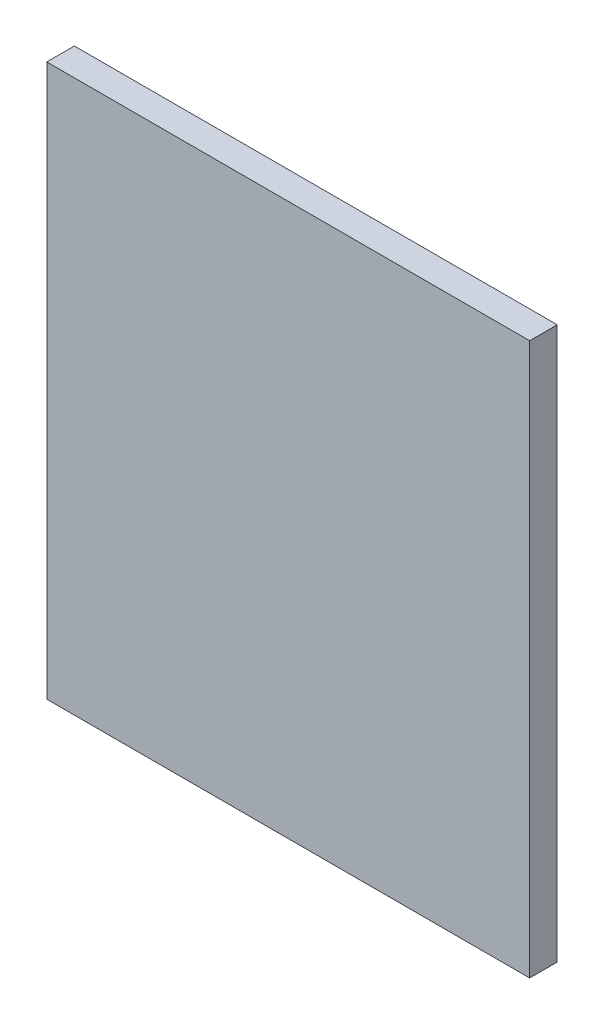
ISO-10303-21;
HEADER;
FILE_DESCRIPTION(('STEP AP214'),'2;1');
FILE_NAME('part.step','',(''),(''),'','','');
FILE_SCHEMA(('AUTOMOTIVE_DESIGN { 1 0 10303 214 1 1 1 1 }'));
ENDSEC;
DATA;
#1=APPLICATION_CONTEXT('core data for automotive mechanical design processes');
#2=APPLICATION_PROTOCOL_DEFINITION('international standard','automotive_design',2000,#1);
#3=PRODUCT_CONTEXT('',#1,'mechanical');
#4=PRODUCT('Part','Part','',(#3));
#5=PRODUCT_RELATED_PRODUCT_CATEGORY('part','',(#4));
#6=PRODUCT_DEFINITION_FORMATION('','',#4);
#7=PRODUCT_DEFINITION_CONTEXT('part definition',#1,'design');
#8=PRODUCT_DEFINITION('design','',#6,#7);
#9=PRODUCT_DEFINITION_SHAPE('','',#8);
#10=(LENGTH_UNIT() NAMED_UNIT(*) SI_UNIT(.MILLI.,.METRE.));
#11=(NAMED_UNIT(*) PLANE_ANGLE_UNIT() SI_UNIT($,.RADIAN.));
#12=(NAMED_UNIT(*) SI_UNIT($,.STERADIAN.) SOLID_ANGLE_UNIT());
#13=UNCERTAINTY_MEASURE_WITH_UNIT(LENGTH_MEASURE(1.E-05),#10,'distance_accuracy_value','');
#14=(GEOMETRIC_REPRESENTATION_CONTEXT(3) GLOBAL_UNCERTAINTY_ASSIGNED_CONTEXT((#13)) GLOBAL_UNIT_ASSIGNED_CONTEXT((#10,
#11,#12)) REPRESENTATION_CONTEXT('',''));
#15=CARTESIAN_POINT('',(0.,0.,0.));
#16=DIRECTION('',(0.,0.,1.));
#17=DIRECTION('',(1.,0.,0.));
#18=AXIS2_PLACEMENT_3D('',#15,#16,#17);
#19=CARTESIAN_POINT('',(175.000000000001,-200.,20.));
#20=DIRECTION('',(-1.,0.,0.));
#21=DIRECTION('',(0.,0.,1.));
#22=AXIS2_PLACEMENT_3D('',#19,#20,#21);
#23=PLANE('',#22);
#24=DIRECTION('',(0.,1.,0.));
#25=VECTOR('',#24,1.);
#26=CARTESIAN_POINT('',(175.000000000001,-200.,0.));
#27=LINE('',#26,#25);
#28=CARTESIAN_POINT('',(175.000000000001,-200.,0.));
#29=VERTEX_POINT('',#28);
#30=CARTESIAN_POINT('',(175.000000000001,200.,0.));
#31=VERTEX_POINT('',#30);
#32=EDGE_CURVE('E96',#29,#31,#27,.T.);
#33=ORIENTED_EDGE('',*,*,#32,.T.);
#34=DIRECTION('',(0.,0.,-1.));
#35=VECTOR('',#34,1.);
#36=CARTESIAN_POINT('',(175.000000000001,200.,20.));
#37=LINE('',#36,#35);
#38=CARTESIAN_POINT('',(175.000000000001,200.,20.));
#39=VERTEX_POINT('',#38);
#40=EDGE_CURVE('E11',#39,#31,#37,.T.);
#41=ORIENTED_EDGE('',*,*,#40,.F.);
#42=DIRECTION('',(0.,1.,0.));
#43=VECTOR('',#42,1.);
#44=CARTESIAN_POINT('',(175.000000000001,-200.,20.));
#45=LINE('',#44,#43);
#46=CARTESIAN_POINT('',(175.000000000001,-200.,20.));
#47=VERTEX_POINT('',#46);
#48=EDGE_CURVE('E84',#47,#39,#45,.T.);
#49=ORIENTED_EDGE('',*,*,#48,.F.);
#50=DIRECTION('',(0.,0.,-1.));
#51=VECTOR('',#50,1.);
#52=CARTESIAN_POINT('',(175.000000000001,-200.,20.));
#53=LINE('',#52,#51);
#54=EDGE_CURVE('E92',#47,#29,#53,.T.);
#55=ORIENTED_EDGE('',*,*,#54,.T.);
#56=EDGE_LOOP('',(#33,#41,#49,#55));
#57=FACE_BOUND('',#56,.T.);
#58=ADVANCED_FACE('F33',(#57),#23,.F.);
#59=CARTESIAN_POINT('',(-174.999999999999,200.,20.));
#60=DIRECTION('',(0.,-1.,0.));
#61=DIRECTION('',(0.,0.,-1.));
#62=AXIS2_PLACEMENT_3D('',#59,#60,#61);
#63=PLANE('',#62);
#64=DIRECTION('',(-1.,0.,0.));
#65=VECTOR('',#64,1.);
#66=CARTESIAN_POINT('',(-174.999999999999,200.,0.));
#67=LINE('',#66,#65);
#68=CARTESIAN_POINT('',(-174.999999999999,200.,0.));
#69=VERTEX_POINT('',#68);
#70=EDGE_CURVE('E88',#31,#69,#67,.T.);
#71=ORIENTED_EDGE('',*,*,#70,.T.);
#72=DIRECTION('',(0.,0.,-1.));
#73=VECTOR('',#72,1.);
#74=CARTESIAN_POINT('',(-174.999999999999,200.,20.));
#75=LINE('',#74,#73);
#76=CARTESIAN_POINT('',(-174.999999999999,200.,20.));
#77=VERTEX_POINT('',#76);
#78=EDGE_CURVE('E41',#77,#69,#75,.T.);
#79=ORIENTED_EDGE('',*,*,#78,.F.);
#80=DIRECTION('',(-1.,0.,0.));
#81=VECTOR('',#80,1.);
#82=CARTESIAN_POINT('',(-174.999999999999,200.,20.));
#83=LINE('',#82,#81);
#84=EDGE_CURVE('E79',#39,#77,#83,.T.);
#85=ORIENTED_EDGE('',*,*,#84,.F.);
#86=ORIENTED_EDGE('',*,*,#40,.T.);
#87=EDGE_LOOP('',(#71,#79,#85,#86));
#88=FACE_BOUND('',#87,.T.);
#89=ADVANCED_FACE('F87',(#88),#63,.F.);
#90=CARTESIAN_POINT('',(-174.999999999999,-200.,20.));
#91=DIRECTION('',(1.,0.,0.));
#92=DIRECTION('',(0.,0.,-1.));
#93=AXIS2_PLACEMENT_3D('',#90,#91,#92);
#94=PLANE('',#93);
#95=DIRECTION('',(0.,-1.,0.));
#96=VECTOR('',#95,1.);
#97=CARTESIAN_POINT('',(-174.999999999999,-200.,0.));
#98=LINE('',#97,#96);
#99=CARTESIAN_POINT('',(-174.999999999999,-200.,0.));
#100=VERTEX_POINT('',#99);
#101=EDGE_CURVE('E66',#69,#100,#98,.T.);
#102=ORIENTED_EDGE('',*,*,#101,.T.);
#103=DIRECTION('',(0.,0.,-1.));
#104=VECTOR('',#103,1.);
#105=CARTESIAN_POINT('',(-174.999999999999,-200.,20.));
#106=LINE('',#105,#104);
#107=CARTESIAN_POINT('',(-174.999999999999,-200.,20.));
#108=VERTEX_POINT('',#107);
#109=EDGE_CURVE('E89',#108,#100,#106,.T.);
#110=ORIENTED_EDGE('',*,*,#109,.F.);
#111=DIRECTION('',(0.,-1.,0.));
#112=VECTOR('',#111,1.);
#113=CARTESIAN_POINT('',(-174.999999999999,-200.,20.));
#114=LINE('',#113,#112);
#115=EDGE_CURVE('E82',#77,#108,#114,.T.);
#116=ORIENTED_EDGE('',*,*,#115,.F.);
#117=ORIENTED_EDGE('',*,*,#78,.T.);
#118=EDGE_LOOP('',(#102,#110,#116,#117));
#119=FACE_BOUND('',#118,.T.);
#120=ADVANCED_FACE('F90',(#119),#94,.F.);
#121=CARTESIAN_POINT('',(-174.999999999999,-200.,20.));
#122=DIRECTION('',(0.,1.,0.));
#123=DIRECTION('',(0.,0.,1.));
#124=AXIS2_PLACEMENT_3D('',#121,#122,#123);
#125=PLANE('',#124);
#126=DIRECTION('',(1.,0.,0.));
#127=VECTOR('',#126,1.);
#128=CARTESIAN_POINT('',(-174.999999999999,-200.,0.));
#129=LINE('',#128,#127);
#130=EDGE_CURVE('E72',#100,#29,#129,.T.);
#131=ORIENTED_EDGE('',*,*,#130,.T.);
#132=ORIENTED_EDGE('',*,*,#54,.F.);
#133=DIRECTION('',(1.,0.,0.));
#134=VECTOR('',#133,1.);
#135=CARTESIAN_POINT('',(-174.999999999999,-200.,20.));
#136=LINE('',#135,#134);
#137=EDGE_CURVE('E49',#108,#47,#136,.T.);
#138=ORIENTED_EDGE('',*,*,#137,.F.);
#139=ORIENTED_EDGE('',*,*,#109,.T.);
#140=EDGE_LOOP('',(#131,#132,#138,#139));
#141=FACE_BOUND('',#140,.T.);
#142=ADVANCED_FACE('F103',(#141),#125,.F.);
#143=CARTESIAN_POINT('',(0.,0.,20.));
#144=DIRECTION('',(0.,0.,-1.));
#145=DIRECTION('',(-1.,0.,0.));
#146=AXIS2_PLACEMENT_3D('',#143,#144,#145);
#147=PLANE('',#146);
#148=ORIENTED_EDGE('',*,*,#48,.T.);
#149=ORIENTED_EDGE('',*,*,#84,.T.);
#150=ORIENTED_EDGE('',*,*,#115,.T.);
#151=ORIENTED_EDGE('',*,*,#137,.T.);
#152=EDGE_LOOP('',(#148,#149,#150,#151));
#153=FACE_BOUND('',#152,.T.);
#154=ADVANCED_FACE('F80',(#153),#147,.F.);
#155=CARTESIAN_POINT('',(0.,0.,0.));
#156=DIRECTION('',(0.,0.,-1.));
#157=DIRECTION('',(-1.,0.,0.));
#158=AXIS2_PLACEMENT_3D('',#155,#156,#157);
#159=PLANE('',#158);
#160=ORIENTED_EDGE('',*,*,#32,.F.);
#161=ORIENTED_EDGE('',*,*,#130,.F.);
#162=ORIENTED_EDGE('',*,*,#101,.F.);
#163=ORIENTED_EDGE('',*,*,#70,.F.);
#164=EDGE_LOOP('',(#160,#161,#162,#163));
#165=FACE_BOUND('',#164,.T.);
#166=ADVANCED_FACE('F106',(#165),#159,.T.);
#167=CLOSED_SHELL('',(#58,#89,#120,#142,#154,#166));
#168=MANIFOLD_SOLID_BREP('B2',#167);
#169=ADVANCED_BREP_SHAPE_REPRESENTATION('',(#18,#168),#14);
#170=SHAPE_DEFINITION_REPRESENTATION(#9,#169);
ENDSEC;
END-ISO-10303-21;
